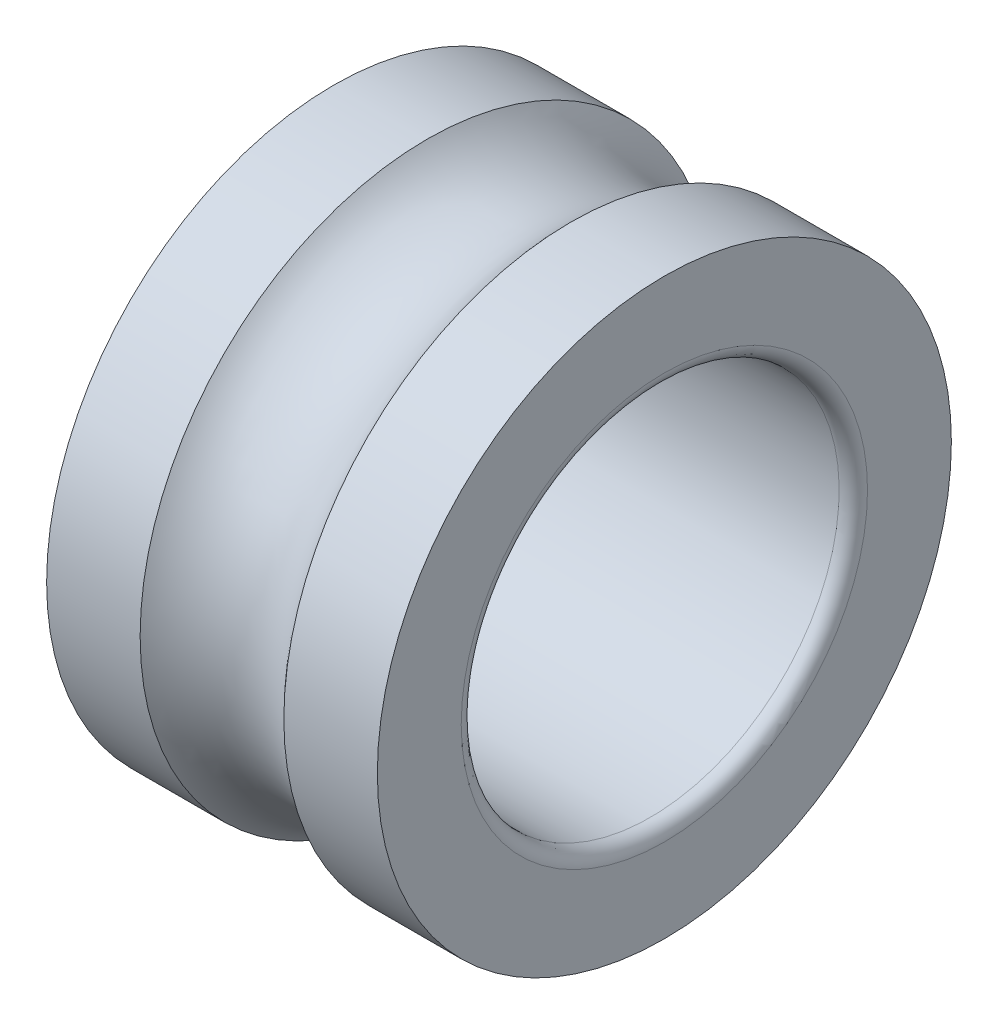
ISO-10303-21;
HEADER;
FILE_DESCRIPTION(('STEP AP214'),'2;1');
FILE_NAME('part.step','',(''),(''),'','','');
FILE_SCHEMA(('AUTOMOTIVE_DESIGN { 1 0 10303 214 1 1 1 1 }'));
ENDSEC;
DATA;
#1=APPLICATION_CONTEXT('core data for automotive mechanical design processes');
#2=APPLICATION_PROTOCOL_DEFINITION('international standard','automotive_design',2000,#1);
#3=PRODUCT_CONTEXT('',#1,'mechanical');
#4=PRODUCT('Part','Part','',(#3));
#5=PRODUCT_RELATED_PRODUCT_CATEGORY('part','',(#4));
#6=PRODUCT_DEFINITION_FORMATION('','',#4);
#7=PRODUCT_DEFINITION_CONTEXT('part definition',#1,'design');
#8=PRODUCT_DEFINITION('design','',#6,#7);
#9=PRODUCT_DEFINITION_SHAPE('','',#8);
#10=(LENGTH_UNIT() NAMED_UNIT(*) SI_UNIT(.MILLI.,.METRE.));
#11=(NAMED_UNIT(*) PLANE_ANGLE_UNIT() SI_UNIT($,.RADIAN.));
#12=(NAMED_UNIT(*) SI_UNIT($,.STERADIAN.) SOLID_ANGLE_UNIT());
#13=UNCERTAINTY_MEASURE_WITH_UNIT(LENGTH_MEASURE(1.E-05),#10,'distance_accuracy_value','');
#14=(GEOMETRIC_REPRESENTATION_CONTEXT(3) GLOBAL_UNCERTAINTY_ASSIGNED_CONTEXT((#13)) GLOBAL_UNIT_ASSIGNED_CONTEXT((#10,
#11,#12)) REPRESENTATION_CONTEXT('',''));
#15=CARTESIAN_POINT('',(0.,0.,0.));
#16=DIRECTION('',(0.,0.,1.));
#17=DIRECTION('',(1.,0.,0.));
#18=AXIS2_PLACEMENT_3D('',#15,#16,#17);
#19=CARTESIAN_POINT('',(6.0103642630345,0.,0.));
#20=DIRECTION('',(-1.,0.,0.));
#21=DIRECTION('',(0.,1.,0.));
#22=AXIS2_PLACEMENT_3D('',#19,#20,#21);
#23=CYLINDRICAL_SURFACE('',#22,6.075);
#24=CARTESIAN_POINT('',(5.020728526069,0.,0.));
#25=DIRECTION('',(1.,0.,0.));
#26=DIRECTION('',(0.,1.,0.));
#27=AXIS2_PLACEMENT_3D('',#24,#25,#26);
#28=CIRCLE('',#27,6.075);
#29=CARTESIAN_POINT('',(5.020728526069,6.075,0.));
#30=VERTEX_POINT('',#29);
#31=EDGE_CURVE('E11',#30,#30,#28,.T.);
#32=ORIENTED_EDGE('',*,*,#31,.T.);
#33=EDGE_LOOP('',(#32));
#34=FACE_BOUND('',#33,.T.);
#35=CARTESIAN_POINT('',(7.,0.,0.));
#36=DIRECTION('',(1.,0.,0.));
#37=DIRECTION('',(0.,1.,0.));
#38=AXIS2_PLACEMENT_3D('',#35,#36,#37);
#39=CIRCLE('',#38,6.075);
#40=CARTESIAN_POINT('',(7.,6.075,0.));
#41=VERTEX_POINT('',#40);
#42=EDGE_CURVE('E51',#41,#41,#39,.T.);
#43=ORIENTED_EDGE('',*,*,#42,.F.);
#44=EDGE_LOOP('',(#43));
#45=FACE_BOUND('',#44,.T.);
#46=ADVANCED_FACE('F16',(#34,#45),#23,.T.);
#47=CARTESIAN_POINT('',(3.5,0.,0.));
#48=DIRECTION('',(1.,0.,0.));
#49=DIRECTION('',(0.,0.,-1.));
#50=AXIS2_PLACEMENT_3D('',#47,#48,#49);
#51=TOROIDAL_SURFACE('',#50,7.35,1.9845);
#52=CARTESIAN_POINT('',(1.979271473931,0.,0.));
#53=DIRECTION('',(1.,0.,0.));
#54=DIRECTION('',(0.,1.,0.));
#55=AXIS2_PLACEMENT_3D('',#52,#53,#54);
#56=CIRCLE('',#55,6.075);
#57=CARTESIAN_POINT('',(1.979271473931,6.075,0.));
#58=VERTEX_POINT('',#57);
#59=EDGE_CURVE('E24',#58,#58,#56,.T.);
#60=ORIENTED_EDGE('',*,*,#59,.T.);
#61=EDGE_LOOP('',(#60));
#62=FACE_BOUND('',#61,.T.);
#63=ORIENTED_EDGE('',*,*,#31,.F.);
#64=EDGE_LOOP('',(#63));
#65=FACE_BOUND('',#64,.T.);
#66=ADVANCED_FACE('F88',(#62,#65),#51,.F.);
#67=CARTESIAN_POINT('',(0.989635736965498,0.,0.));
#68=DIRECTION('',(-1.,0.,0.));
#69=DIRECTION('',(0.,1.,0.));
#70=AXIS2_PLACEMENT_3D('',#67,#68,#69);
#71=CYLINDRICAL_SURFACE('',#70,6.075);
#72=CARTESIAN_POINT('',(0.,0.,0.));
#73=DIRECTION('',(1.,0.,0.));
#74=DIRECTION('',(0.,1.,0.));
#75=AXIS2_PLACEMENT_3D('',#72,#73,#74);
#76=CIRCLE('',#75,6.075);
#77=CARTESIAN_POINT('',(0.,6.075,0.));
#78=VERTEX_POINT('',#77);
#79=EDGE_CURVE('E61',#78,#78,#76,.T.);
#80=ORIENTED_EDGE('',*,*,#79,.T.);
#81=EDGE_LOOP('',(#80));
#82=FACE_BOUND('',#81,.T.);
#83=ORIENTED_EDGE('',*,*,#59,.F.);
#84=EDGE_LOOP('',(#83));
#85=FACE_BOUND('',#84,.T.);
#86=ADVANCED_FACE('F92',(#82,#85),#71,.T.);
#87=CARTESIAN_POINT('',(0.,5.1875,0.));
#88=DIRECTION('',(-1.,0.,0.));
#89=DIRECTION('',(0.,-1.,0.));
#90=AXIS2_PLACEMENT_3D('',#87,#88,#89);
#91=PLANE('',#90);
#92=CARTESIAN_POINT('',(0.,0.,0.));
#93=DIRECTION('',(1.,0.,0.));
#94=DIRECTION('',(0.,1.,0.));
#95=AXIS2_PLACEMENT_3D('',#92,#93,#94);
#96=CIRCLE('',#95,4.3);
#97=CARTESIAN_POINT('',(0.,4.3,0.));
#98=VERTEX_POINT('',#97);
#99=EDGE_CURVE('E64',#98,#98,#96,.T.);
#100=ORIENTED_EDGE('',*,*,#99,.T.);
#101=EDGE_LOOP('',(#100));
#102=FACE_BOUND('',#101,.T.);
#103=ORIENTED_EDGE('',*,*,#79,.F.);
#104=EDGE_LOOP('',(#103));
#105=FACE_BOUND('',#104,.T.);
#106=ADVANCED_FACE('F84',(#102,#105),#91,.T.);
#107=CARTESIAN_POINT('',(0.3,0.,0.));
#108=DIRECTION('',(1.,0.,0.));
#109=DIRECTION('',(0.,0.,-1.));
#110=AXIS2_PLACEMENT_3D('',#107,#108,#109);
#111=TOROIDAL_SURFACE('',#110,4.3,0.3);
#112=CARTESIAN_POINT('',(0.3,0.,0.));
#113=DIRECTION('',(1.,0.,0.));
#114=DIRECTION('',(0.,1.,0.));
#115=AXIS2_PLACEMENT_3D('',#112,#113,#114);
#116=CIRCLE('',#115,4.);
#117=CARTESIAN_POINT('',(0.3,4.,0.));
#118=VERTEX_POINT('',#117);
#119=EDGE_CURVE('E19',#118,#118,#116,.T.);
#120=ORIENTED_EDGE('',*,*,#119,.T.);
#121=EDGE_LOOP('',(#120));
#122=FACE_BOUND('',#121,.T.);
#123=ORIENTED_EDGE('',*,*,#99,.F.);
#124=EDGE_LOOP('',(#123));
#125=FACE_BOUND('',#124,.T.);
#126=ADVANCED_FACE('F69',(#122,#125),#111,.T.);
#127=CARTESIAN_POINT('',(3.5,0.,0.));
#128=DIRECTION('',(-1.,0.,0.));
#129=DIRECTION('',(0.,1.,0.));
#130=AXIS2_PLACEMENT_3D('',#127,#128,#129);
#131=CYLINDRICAL_SURFACE('',#130,4.);
#132=CARTESIAN_POINT('',(6.7,0.,0.));
#133=DIRECTION('',(1.,0.,0.));
#134=DIRECTION('',(0.,1.,0.));
#135=AXIS2_PLACEMENT_3D('',#132,#133,#134);
#136=CIRCLE('',#135,4.);
#137=CARTESIAN_POINT('',(6.7,4.,0.));
#138=VERTEX_POINT('',#137);
#139=EDGE_CURVE('E55',#138,#138,#136,.T.);
#140=ORIENTED_EDGE('',*,*,#139,.T.);
#141=EDGE_LOOP('',(#140));
#142=FACE_BOUND('',#141,.T.);
#143=ORIENTED_EDGE('',*,*,#119,.F.);
#144=EDGE_LOOP('',(#143));
#145=FACE_BOUND('',#144,.T.);
#146=ADVANCED_FACE('F72',(#142,#145),#131,.F.);
#147=CARTESIAN_POINT('',(6.7,0.,0.));
#148=DIRECTION('',(1.,0.,0.));
#149=DIRECTION('',(0.,0.,-1.));
#150=AXIS2_PLACEMENT_3D('',#147,#148,#149);
#151=TOROIDAL_SURFACE('',#150,4.3,0.3);
#152=CARTESIAN_POINT('',(7.,0.,0.));
#153=DIRECTION('',(1.,0.,0.));
#154=DIRECTION('',(0.,1.,0.));
#155=AXIS2_PLACEMENT_3D('',#152,#153,#154);
#156=CIRCLE('',#155,4.3);
#157=CARTESIAN_POINT('',(7.,4.3,0.));
#158=VERTEX_POINT('',#157);
#159=EDGE_CURVE('E56',#158,#158,#156,.T.);
#160=ORIENTED_EDGE('',*,*,#159,.T.);
#161=EDGE_LOOP('',(#160));
#162=FACE_BOUND('',#161,.T.);
#163=ORIENTED_EDGE('',*,*,#139,.F.);
#164=EDGE_LOOP('',(#163));
#165=FACE_BOUND('',#164,.T.);
#166=ADVANCED_FACE('F74',(#162,#165),#151,.T.);
#167=CARTESIAN_POINT('',(7.,5.1875,0.));
#168=DIRECTION('',(1.,0.,0.));
#169=DIRECTION('',(0.,1.,0.));
#170=AXIS2_PLACEMENT_3D('',#167,#168,#169);
#171=PLANE('',#170);
#172=ORIENTED_EDGE('',*,*,#42,.T.);
#173=EDGE_LOOP('',(#172));
#174=FACE_BOUND('',#173,.T.);
#175=ORIENTED_EDGE('',*,*,#159,.F.);
#176=EDGE_LOOP('',(#175));
#177=FACE_BOUND('',#176,.T.);
#178=ADVANCED_FACE('F52',(#174,#177),#171,.T.);
#179=CLOSED_SHELL('',(#46,#66,#86,#106,#126,#146,#166,#178));
#180=MANIFOLD_SOLID_BREP('B1',#179);
#181=ADVANCED_BREP_SHAPE_REPRESENTATION('',(#18,#180),#14);
#182=SHAPE_DEFINITION_REPRESENTATION(#9,#181);
ENDSEC;
END-ISO-10303-21;
